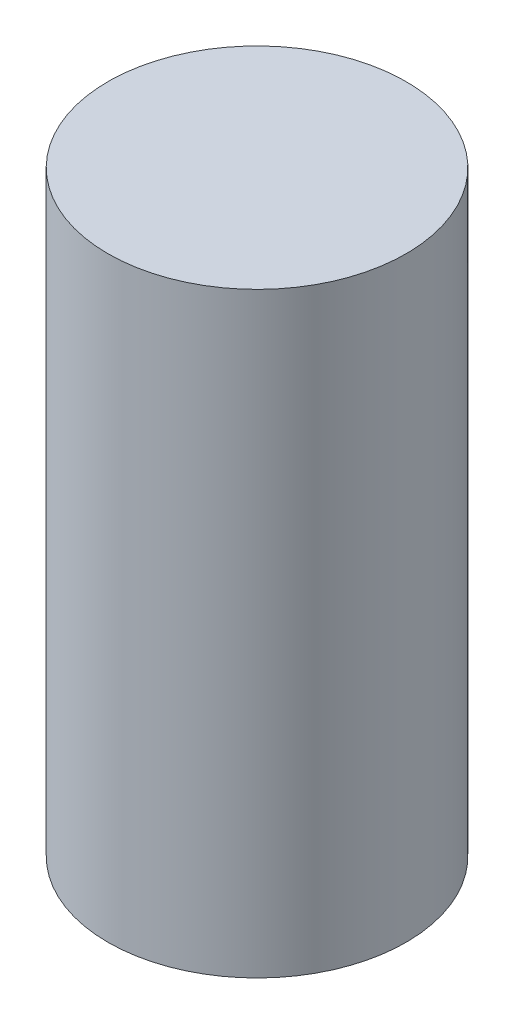
ISO-10303-21;
HEADER;
FILE_DESCRIPTION(('STEP AP214'),'2;1');
FILE_NAME('part.step','',(''),(''),'','','');
FILE_SCHEMA(('AUTOMOTIVE_DESIGN { 1 0 10303 214 1 1 1 1 }'));
ENDSEC;
DATA;
#1=APPLICATION_CONTEXT('core data for automotive mechanical design processes');
#2=APPLICATION_PROTOCOL_DEFINITION('international standard','automotive_design',2000,#1);
#3=PRODUCT_CONTEXT('',#1,'mechanical');
#4=PRODUCT('Part','Part','',(#3));
#5=PRODUCT_RELATED_PRODUCT_CATEGORY('part','',(#4));
#6=PRODUCT_DEFINITION_FORMATION('','',#4);
#7=PRODUCT_DEFINITION_CONTEXT('part definition',#1,'design');
#8=PRODUCT_DEFINITION('design','',#6,#7);
#9=PRODUCT_DEFINITION_SHAPE('','',#8);
#10=(LENGTH_UNIT() NAMED_UNIT(*) SI_UNIT(.MILLI.,.METRE.));
#11=(NAMED_UNIT(*) PLANE_ANGLE_UNIT() SI_UNIT($,.RADIAN.));
#12=(NAMED_UNIT(*) SI_UNIT($,.STERADIAN.) SOLID_ANGLE_UNIT());
#13=UNCERTAINTY_MEASURE_WITH_UNIT(LENGTH_MEASURE(1.E-05),#10,'distance_accuracy_value','');
#14=(GEOMETRIC_REPRESENTATION_CONTEXT(3) GLOBAL_UNCERTAINTY_ASSIGNED_CONTEXT((#13)) GLOBAL_UNIT_ASSIGNED_CONTEXT((#10,
#11,#12)) REPRESENTATION_CONTEXT('',''));
#15=CARTESIAN_POINT('',(0.,0.,0.));
#16=DIRECTION('',(0.,0.,1.));
#17=DIRECTION('',(1.,0.,0.));
#18=AXIS2_PLACEMENT_3D('',#15,#16,#17);
#19=CARTESIAN_POINT('',(0.,60.,0.));
#20=DIRECTION('',(0.,-1.,0.));
#21=DIRECTION('',(0.,0.,-1.));
#22=AXIS2_PLACEMENT_3D('',#19,#20,#21);
#23=CYLINDRICAL_SURFACE('',#22,15.);
#24=CARTESIAN_POINT('',(0.,60.,0.));
#25=DIRECTION('',(0.,1.,0.));
#26=DIRECTION('',(0.,0.,1.));
#27=AXIS2_PLACEMENT_3D('',#24,#25,#26);
#28=CIRCLE('',#27,15.);
#29=CARTESIAN_POINT('',(0.,60.,15.));
#30=VERTEX_POINT('',#29);
#31=EDGE_CURVE('E10',#30,#30,#28,.T.);
#32=ORIENTED_EDGE('',*,*,#31,.F.);
#33=EDGE_LOOP('',(#32));
#34=FACE_BOUND('',#33,.T.);
#35=CARTESIAN_POINT('',(0.,0.,0.));
#36=DIRECTION('',(0.,1.,0.));
#37=DIRECTION('',(0.,0.,1.));
#38=AXIS2_PLACEMENT_3D('',#35,#36,#37);
#39=CIRCLE('',#38,15.);
#40=CARTESIAN_POINT('',(0.,0.,15.));
#41=VERTEX_POINT('',#40);
#42=EDGE_CURVE('E40',#41,#41,#39,.T.);
#43=ORIENTED_EDGE('',*,*,#42,.T.);
#44=EDGE_LOOP('',(#43));
#45=FACE_BOUND('',#44,.T.);
#46=ADVANCED_FACE('F37',(#34,#45),#23,.T.);
#47=CARTESIAN_POINT('',(0.,60.,0.));
#48=DIRECTION('',(0.,1.,0.));
#49=DIRECTION('',(0.,0.,1.));
#50=AXIS2_PLACEMENT_3D('',#47,#48,#49);
#51=PLANE('',#50);
#52=ORIENTED_EDGE('',*,*,#31,.T.);
#53=EDGE_LOOP('',(#52));
#54=FACE_BOUND('',#53,.T.);
#55=ADVANCED_FACE('F54',(#54),#51,.T.);
#56=CARTESIAN_POINT('',(0.,0.,0.));
#57=DIRECTION('',(0.,1.,0.));
#58=DIRECTION('',(0.,0.,1.));
#59=AXIS2_PLACEMENT_3D('',#56,#57,#58);
#60=PLANE('',#59);
#61=ORIENTED_EDGE('',*,*,#42,.F.);
#62=EDGE_LOOP('',(#61));
#63=FACE_BOUND('',#62,.T.);
#64=ADVANCED_FACE('F52',(#63),#60,.F.);
#65=CLOSED_SHELL('',(#46,#55,#64));
#66=MANIFOLD_SOLID_BREP('B2',#65);
#67=ADVANCED_BREP_SHAPE_REPRESENTATION('',(#18,#66),#14);
#68=SHAPE_DEFINITION_REPRESENTATION(#9,#67);
ENDSEC;
END-ISO-10303-21;
